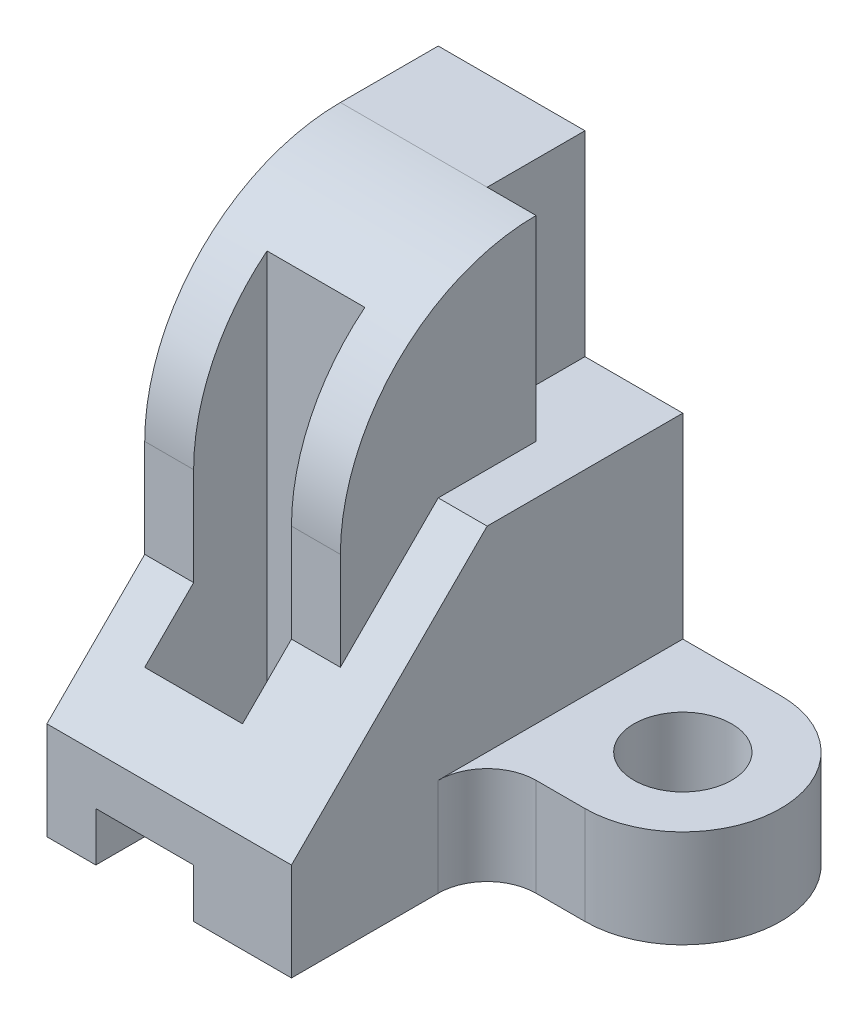
ISO-10303-21;
HEADER;
FILE_DESCRIPTION(('STEP AP214'),'2;1');
FILE_NAME('part.step','',(''),(''),'','','');
FILE_SCHEMA(('AUTOMOTIVE_DESIGN { 1 0 10303 214 1 1 1 1 }'));
ENDSEC;
DATA;
#1=APPLICATION_CONTEXT('core data for automotive mechanical design processes');
#2=APPLICATION_PROTOCOL_DEFINITION('international standard','automotive_design',2000,#1);
#3=PRODUCT_CONTEXT('',#1,'mechanical');
#4=PRODUCT('Part','Part','',(#3));
#5=PRODUCT_RELATED_PRODUCT_CATEGORY('part','',(#4));
#6=PRODUCT_DEFINITION_FORMATION('','',#4);
#7=PRODUCT_DEFINITION_CONTEXT('part definition',#1,'design');
#8=PRODUCT_DEFINITION('design','',#6,#7);
#9=PRODUCT_DEFINITION_SHAPE('','',#8);
#10=(LENGTH_UNIT() NAMED_UNIT(*) SI_UNIT(.MILLI.,.METRE.));
#11=(NAMED_UNIT(*) PLANE_ANGLE_UNIT() SI_UNIT($,.RADIAN.));
#12=(NAMED_UNIT(*) SI_UNIT($,.STERADIAN.) SOLID_ANGLE_UNIT());
#13=UNCERTAINTY_MEASURE_WITH_UNIT(LENGTH_MEASURE(1.E-05),#10,'distance_accuracy_value','');
#14=(GEOMETRIC_REPRESENTATION_CONTEXT(3) GLOBAL_UNCERTAINTY_ASSIGNED_CONTEXT((#13)) GLOBAL_UNIT_ASSIGNED_CONTEXT((#10,
#11,#12)) REPRESENTATION_CONTEXT('',''));
#15=CARTESIAN_POINT('',(0.,0.,0.));
#16=DIRECTION('',(0.,0.,1.));
#17=DIRECTION('',(1.,0.,0.));
#18=AXIS2_PLACEMENT_3D('',#15,#16,#17);
#19=CARTESIAN_POINT('',(-6.,4.,6.));
#20=DIRECTION('',(0.,0.,-1.));
#21=DIRECTION('',(-1.,0.,0.));
#22=AXIS2_PLACEMENT_3D('',#19,#20,#21);
#23=PLANE('',#22);
#24=DIRECTION('',(1.,0.,0.));
#25=VECTOR('',#24,1.);
#26=CARTESIAN_POINT('',(-6.,6.,6.));
#27=LINE('',#26,#25);
#28=CARTESIAN_POINT('',(-2.,6.,6.));
#29=VERTEX_POINT('',#28);
#30=CARTESIAN_POINT('',(-1.,6.,6.));
#31=VERTEX_POINT('',#30);
#32=EDGE_CURVE('E256',#29,#31,#27,.T.);
#33=ORIENTED_EDGE('',*,*,#32,.F.);
#34=DIRECTION('',(0.,-1.,0.));
#35=VECTOR('',#34,1.);
#36=CARTESIAN_POINT('',(-2.,4.,6.));
#37=LINE('',#36,#35);
#38=CARTESIAN_POINT('',(-2.,4.,6.));
#39=VERTEX_POINT('',#38);
#40=EDGE_CURVE('E260',#29,#39,#37,.T.);
#41=ORIENTED_EDGE('',*,*,#40,.T.);
#42=DIRECTION('',(1.,0.,0.));
#43=VECTOR('',#42,1.);
#44=CARTESIAN_POINT('',(-6.,4.,6.));
#45=LINE('',#44,#43);
#46=CARTESIAN_POINT('',(-1.,4.,6.));
#47=VERTEX_POINT('',#46);
#48=EDGE_CURVE('E271',#39,#47,#45,.T.);
#49=ORIENTED_EDGE('',*,*,#48,.T.);
#50=DIRECTION('',(0.,-1.,0.));
#51=VECTOR('',#50,1.);
#52=CARTESIAN_POINT('',(-1.,4.,6.));
#53=LINE('',#52,#51);
#54=EDGE_CURVE('E263',#31,#47,#53,.T.);
#55=ORIENTED_EDGE('',*,*,#54,.F.);
#56=EDGE_LOOP('',(#33,#41,#49,#55));
#57=FACE_BOUND('',#56,.T.);
#58=ADVANCED_FACE('F33',(#57),#23,.F.);
#59=CARTESIAN_POINT('',(-2.,1.,8.));
#60=DIRECTION('',(0.,1.,0.));
#61=DIRECTION('',(-1.,0.,0.));
#62=AXIS2_PLACEMENT_3D('',#59,#60,#61);
#63=PLANE('',#62);
#64=DIRECTION('',(0.,0.,-1.));
#65=VECTOR('',#64,1.);
#66=CARTESIAN_POINT('',(-2.,1.,8.));
#67=LINE('',#66,#65);
#68=CARTESIAN_POINT('',(-2.,1.,4.5));
#69=VERTEX_POINT('',#68);
#70=CARTESIAN_POINT('',(-2.,1.,0.));
#71=VERTEX_POINT('',#70);
#72=EDGE_CURVE('E222',#69,#71,#67,.T.);
#73=ORIENTED_EDGE('',*,*,#72,.F.);
#74=DIRECTION('',(1.,0.,0.));
#75=VECTOR('',#74,1.);
#76=CARTESIAN_POINT('',(-4.,1.,4.5));
#77=LINE('',#76,#75);
#78=CARTESIAN_POINT('',(-4.,1.,4.5));
#79=VERTEX_POINT('',#78);
#80=EDGE_CURVE('E48',#79,#69,#77,.T.);
#81=ORIENTED_EDGE('',*,*,#80,.F.);
#82=DIRECTION('',(0.,0.,-1.));
#83=VECTOR('',#82,1.);
#84=CARTESIAN_POINT('',(-4.,1.,8.));
#85=LINE('',#84,#83);
#86=CARTESIAN_POINT('',(-4.,1.,0.));
#87=VERTEX_POINT('',#86);
#88=EDGE_CURVE('E221',#79,#87,#85,.T.);
#89=ORIENTED_EDGE('',*,*,#88,.T.);
#90=DIRECTION('',(1.,0.,0.));
#91=VECTOR('',#90,1.);
#92=CARTESIAN_POINT('',(-2.,1.,0.));
#93=LINE('',#92,#91);
#94=EDGE_CURVE('E381',#87,#71,#93,.T.);
#95=ORIENTED_EDGE('',*,*,#94,.T.);
#96=EDGE_LOOP('',(#73,#81,#89,#95));
#97=FACE_BOUND('',#96,.T.);
#98=ADVANCED_FACE('F426',(#97),#63,.F.);
#99=CARTESIAN_POINT('',(-5.,4.,6.));
#100=VERTEX_POINT('',#99);
#101=CARTESIAN_POINT('',(-4.,4.,6.));
#102=VERTEX_POINT('',#101);
#103=EDGE_CURVE('E266',#100,#102,#45,.T.);
#104=ORIENTED_EDGE('',*,*,#103,.T.);
#105=DIRECTION('',(0.,1.,0.));
#106=VECTOR('',#105,1.);
#107=CARTESIAN_POINT('',(-4.,4.,6.));
#108=LINE('',#107,#106);
#109=CARTESIAN_POINT('',(-4.,6.,6.));
#110=VERTEX_POINT('',#109);
#111=EDGE_CURVE('E447',#102,#110,#108,.T.);
#112=ORIENTED_EDGE('',*,*,#111,.T.);
#113=CARTESIAN_POINT('',(-5.,6.,6.));
#114=VERTEX_POINT('',#113);
#115=EDGE_CURVE('E265',#114,#110,#27,.T.);
#116=ORIENTED_EDGE('',*,*,#115,.F.);
#117=DIRECTION('',(0.,1.,0.));
#118=VECTOR('',#117,1.);
#119=CARTESIAN_POINT('',(-5.,0.,6.));
#120=LINE('',#119,#118);
#121=EDGE_CURVE('E244',#100,#114,#120,.T.);
#122=ORIENTED_EDGE('',*,*,#121,.F.);
#123=EDGE_LOOP('',(#104,#112,#116,#122));
#124=FACE_BOUND('',#123,.T.);
#125=ADVANCED_FACE('F428',(#124),#23,.F.);
#126=CARTESIAN_POINT('',(-5.,10.,8.));
#127=DIRECTION('',(0.,-1.,0.));
#128=DIRECTION('',(0.,0.,-1.));
#129=AXIS2_PLACEMENT_3D('',#126,#127,#128);
#130=PLANE('',#129);
#131=DIRECTION('',(1.,0.,0.));
#132=VECTOR('',#131,1.);
#133=CARTESIAN_POINT('',(-6.,10.,2.));
#134=LINE('',#133,#132);
#135=CARTESIAN_POINT('',(-5.,10.,2.));
#136=VERTEX_POINT('',#135);
#137=CARTESIAN_POINT('',(-2.,10.,2.));
#138=VERTEX_POINT('',#137);
#139=EDGE_CURVE('E277',#136,#138,#134,.T.);
#140=ORIENTED_EDGE('',*,*,#139,.T.);
#141=DIRECTION('',(0.,0.,1.));
#142=VECTOR('',#141,1.);
#143=CARTESIAN_POINT('',(-2.,10.,0.));
#144=LINE('',#143,#142);
#145=CARTESIAN_POINT('',(-2.,10.,0.));
#146=VERTEX_POINT('',#145);
#147=EDGE_CURVE('E290',#146,#138,#144,.T.);
#148=ORIENTED_EDGE('',*,*,#147,.F.);
#149=DIRECTION('',(-1.,0.,0.));
#150=VECTOR('',#149,1.);
#151=CARTESIAN_POINT('',(-5.,10.,0.));
#152=LINE('',#151,#150);
#153=CARTESIAN_POINT('',(-5.,10.,0.));
#154=VERTEX_POINT('',#153);
#155=EDGE_CURVE('E371',#146,#154,#152,.T.);
#156=ORIENTED_EDGE('',*,*,#155,.T.);
#157=DIRECTION('',(0.,0.,-1.));
#158=VECTOR('',#157,1.);
#159=CARTESIAN_POINT('',(-5.,10.,8.));
#160=LINE('',#159,#158);
#161=EDGE_CURVE('E235',#136,#154,#160,.T.);
#162=ORIENTED_EDGE('',*,*,#161,.F.);
#163=EDGE_LOOP('',(#140,#148,#156,#162));
#164=FACE_BOUND('',#163,.T.);
#165=ADVANCED_FACE('F437',(#164),#130,.F.);
#166=CARTESIAN_POINT('',(0.,6.,8.));
#167=DIRECTION('',(-1.,0.,0.));
#168=DIRECTION('',(0.,-1.,0.));
#169=AXIS2_PLACEMENT_3D('',#166,#167,#168);
#170=PLANE('',#169);
#171=DIRECTION('',(0.,0.,-1.));
#172=VECTOR('',#171,1.);
#173=CARTESIAN_POINT('',(0.,6.,8.));
#174=LINE('',#173,#172);
#175=CARTESIAN_POINT('',(0.,6.,4.));
#176=VERTEX_POINT('',#175);
#177=CARTESIAN_POINT('',(0.,6.,0.));
#178=VERTEX_POINT('',#177);
#179=EDGE_CURVE('E239',#176,#178,#174,.T.);
#180=ORIENTED_EDGE('',*,*,#179,.F.);
#181=DIRECTION('',(0.,-0.707106781186548,0.707106781186547));
#182=VECTOR('',#181,1.);
#183=CARTESIAN_POINT('',(0.,4.,6.));
#184=LINE('',#183,#182);
#185=CARTESIAN_POINT('',(0.,2.,8.));
#186=VERTEX_POINT('',#185);
#187=EDGE_CURVE('E287',#176,#186,#184,.T.);
#188=ORIENTED_EDGE('',*,*,#187,.T.);
#189=DIRECTION('',(0.,1.,0.));
#190=VECTOR('',#189,1.);
#191=CARTESIAN_POINT('',(0.,6.,8.));
#192=LINE('',#191,#190);
#193=CARTESIAN_POINT('',(0.,0.,8.));
#194=VERTEX_POINT('',#193);
#195=EDGE_CURVE('E351',#194,#186,#192,.T.);
#196=ORIENTED_EDGE('',*,*,#195,.F.);
#197=DIRECTION('',(0.,0.,-1.));
#198=VECTOR('',#197,1.);
#199=CARTESIAN_POINT('',(0.,0.,8.));
#200=LINE('',#199,#198);
#201=CARTESIAN_POINT('',(0.,0.,5.));
#202=VERTEX_POINT('',#201);
#203=EDGE_CURVE('E366',#194,#202,#200,.T.);
#204=ORIENTED_EDGE('',*,*,#203,.T.);
#205=DIRECTION('',(0.,-1.,0.));
#206=VECTOR('',#205,1.);
#207=CARTESIAN_POINT('',(0.,2.,5.));
#208=LINE('',#207,#206);
#209=CARTESIAN_POINT('',(0.,2.,5.));
#210=VERTEX_POINT('',#209);
#211=EDGE_CURVE('E341',#210,#202,#208,.T.);
#212=ORIENTED_EDGE('',*,*,#211,.F.);
#213=DIRECTION('',(0.,0.,-1.));
#214=VECTOR('',#213,1.);
#215=CARTESIAN_POINT('',(0.,2.,5.));
#216=LINE('',#215,#214);
#217=CARTESIAN_POINT('',(0.,2.,0.));
#218=VERTEX_POINT('',#217);
#219=EDGE_CURVE('E317',#210,#218,#216,.T.);
#220=ORIENTED_EDGE('',*,*,#219,.T.);
#221=DIRECTION('',(0.,1.,0.));
#222=VECTOR('',#221,1.);
#223=CARTESIAN_POINT('',(0.,6.,0.));
#224=LINE('',#223,#222);
#225=EDGE_CURVE('E344',#218,#178,#224,.T.);
#226=ORIENTED_EDGE('',*,*,#225,.T.);
#227=EDGE_LOOP('',(#180,#188,#196,#204,#212,#220,#226));
#228=FACE_BOUND('',#227,.T.);
#229=ADVANCED_FACE('F35',(#228),#170,.F.);
#230=CARTESIAN_POINT('',(-1.,6.,8.));
#231=DIRECTION('',(0.,-1.,0.));
#232=DIRECTION('',(0.,0.,-1.));
#233=AXIS2_PLACEMENT_3D('',#230,#231,#232);
#234=PLANE('',#233);
#235=DIRECTION('',(0.,0.,-1.));
#236=VECTOR('',#235,1.);
#237=CARTESIAN_POINT('',(-1.,6.,8.));
#238=LINE('',#237,#236);
#239=CARTESIAN_POINT('',(-1.,6.,4.));
#240=VERTEX_POINT('',#239);
#241=CARTESIAN_POINT('',(-1.,6.,2.));
#242=VERTEX_POINT('',#241);
#243=EDGE_CURVE('E237',#240,#242,#238,.T.);
#244=ORIENTED_EDGE('',*,*,#243,.F.);
#245=DIRECTION('',(1.,0.,0.));
#246=VECTOR('',#245,1.);
#247=CARTESIAN_POINT('',(-1.,6.,4.));
#248=LINE('',#247,#246);
#249=EDGE_CURVE('E274',#240,#176,#248,.T.);
#250=ORIENTED_EDGE('',*,*,#249,.T.);
#251=ORIENTED_EDGE('',*,*,#179,.T.);
#252=DIRECTION('',(-1.,0.,0.));
#253=VECTOR('',#252,1.);
#254=CARTESIAN_POINT('',(-1.,6.,0.));
#255=LINE('',#254,#253);
#256=CARTESIAN_POINT('',(-2.,6.,0.));
#257=VERTEX_POINT('',#256);
#258=EDGE_CURVE('E369',#178,#257,#255,.T.);
#259=ORIENTED_EDGE('',*,*,#258,.T.);
#260=DIRECTION('',(0.,0.,1.));
#261=VECTOR('',#260,1.);
#262=CARTESIAN_POINT('',(-2.,6.,0.));
#263=LINE('',#262,#261);
#264=CARTESIAN_POINT('',(-2.,6.,2.));
#265=VERTEX_POINT('',#264);
#266=EDGE_CURVE('E291',#257,#265,#263,.T.);
#267=ORIENTED_EDGE('',*,*,#266,.T.);
#268=DIRECTION('',(1.,0.,0.));
#269=VECTOR('',#268,1.);
#270=CARTESIAN_POINT('',(-2.,6.,2.));
#271=LINE('',#270,#269);
#272=EDGE_CURVE('E294',#265,#242,#271,.T.);
#273=ORIENTED_EDGE('',*,*,#272,.T.);
#274=EDGE_LOOP('',(#244,#250,#251,#259,#267,#273));
#275=FACE_BOUND('',#274,.T.);
#276=ADVANCED_FACE('F464',(#275),#234,.F.);
#277=CARTESIAN_POINT('',(-1.,10.,8.));
#278=DIRECTION('',(-1.,0.,0.));
#279=DIRECTION('',(0.,-1.,0.));
#280=AXIS2_PLACEMENT_3D('',#277,#278,#279);
#281=PLANE('',#280);
#282=DIRECTION('',(0.,1.,0.));
#283=VECTOR('',#282,1.);
#284=CARTESIAN_POINT('',(-1.,6.,2.));
#285=LINE('',#284,#283);
#286=CARTESIAN_POINT('',(-1.,10.,2.));
#287=VERTEX_POINT('',#286);
#288=EDGE_CURVE('E303',#242,#287,#285,.T.);
#289=ORIENTED_EDGE('',*,*,#288,.T.);
#290=CARTESIAN_POINT('',(-0.999999999999999,5.99999999999997,1.99999999999997));
#291=DIRECTION('',(-1.,0.,0.));
#292=DIRECTION('',(0.,-1.,0.));
#293=AXIS2_PLACEMENT_3D('',#290,#291,#292);
#294=CIRCLE('',#293,4.00000000000003);
#295=EDGE_CURVE('E282',#287,#31,#294,.F.);
#296=ORIENTED_EDGE('',*,*,#295,.T.);
#297=ORIENTED_EDGE('',*,*,#54,.T.);
#298=DIRECTION('',(0.,0.707106781186548,-0.707106781186548));
#299=VECTOR('',#298,1.);
#300=CARTESIAN_POINT('',(-1.,6.,4.));
#301=LINE('',#300,#299);
#302=EDGE_CURVE('E468',#47,#240,#301,.T.);
#303=ORIENTED_EDGE('',*,*,#302,.T.);
#304=ORIENTED_EDGE('',*,*,#243,.T.);
#305=EDGE_LOOP('',(#289,#296,#297,#303,#304));
#306=FACE_BOUND('',#305,.T.);
#307=ADVANCED_FACE('F496',(#306),#281,.F.);
#308=CARTESIAN_POINT('',(-5.,0.,8.));
#309=DIRECTION('',(1.,0.,0.));
#310=DIRECTION('',(0.,0.,-1.));
#311=AXIS2_PLACEMENT_3D('',#308,#309,#310);
#312=PLANE('',#311);
#313=ORIENTED_EDGE('',*,*,#121,.T.);
#314=CARTESIAN_POINT('',(-5.,5.99999999999997,1.99999999999997));
#315=DIRECTION('',(1.,0.,0.));
#316=DIRECTION('',(0.,0.,-1.));
#317=AXIS2_PLACEMENT_3D('',#314,#315,#316);
#318=CIRCLE('',#317,4.00000000000003);
#319=EDGE_CURVE('E269',#114,#136,#318,.F.);
#320=ORIENTED_EDGE('',*,*,#319,.T.);
#321=ORIENTED_EDGE('',*,*,#161,.T.);
#322=DIRECTION('',(0.,-1.,0.));
#323=VECTOR('',#322,1.);
#324=CARTESIAN_POINT('',(-5.,0.,0.));
#325=LINE('',#324,#323);
#326=CARTESIAN_POINT('',(-5.,0.,0.));
#327=VERTEX_POINT('',#326);
#328=EDGE_CURVE('E374',#154,#327,#325,.T.);
#329=ORIENTED_EDGE('',*,*,#328,.T.);
#330=DIRECTION('',(0.,0.,-1.));
#331=VECTOR('',#330,1.);
#332=CARTESIAN_POINT('',(-5.,0.,8.));
#333=LINE('',#332,#331);
#334=CARTESIAN_POINT('',(-5.,0.,8.));
#335=VERTEX_POINT('',#334);
#336=EDGE_CURVE('E232',#335,#327,#333,.T.);
#337=ORIENTED_EDGE('',*,*,#336,.F.);
#338=DIRECTION('',(0.,-1.,0.));
#339=VECTOR('',#338,1.);
#340=CARTESIAN_POINT('',(-5.,0.,8.));
#341=LINE('',#340,#339);
#342=CARTESIAN_POINT('',(-5.,2.,8.));
#343=VERTEX_POINT('',#342);
#344=EDGE_CURVE('E354',#343,#335,#341,.T.);
#345=ORIENTED_EDGE('',*,*,#344,.F.);
#346=DIRECTION('',(0.,0.707106781186548,-0.707106781186547));
#347=VECTOR('',#346,1.);
#348=CARTESIAN_POINT('',(-5.,0.999999999999997,9.));
#349=LINE('',#348,#347);
#350=EDGE_CURVE('E284',#343,#100,#349,.T.);
#351=ORIENTED_EDGE('',*,*,#350,.T.);
#352=EDGE_LOOP('',(#313,#320,#321,#329,#337,#345,#351));
#353=FACE_BOUND('',#352,.T.);
#354=ADVANCED_FACE('F454',(#353),#312,.F.);
#355=CARTESIAN_POINT('',(-4.,0.,8.));
#356=DIRECTION('',(0.,1.,0.));
#357=DIRECTION('',(-1.,0.,0.));
#358=AXIS2_PLACEMENT_3D('',#355,#356,#357);
#359=PLANE('',#358);
#360=DIRECTION('',(1.,0.,0.));
#361=VECTOR('',#360,1.);
#362=CARTESIAN_POINT('',(-4.,0.,0.));
#363=LINE('',#362,#361);
#364=CARTESIAN_POINT('',(-4.,0.,0.));
#365=VERTEX_POINT('',#364);
#366=EDGE_CURVE('E376',#327,#365,#363,.T.);
#367=ORIENTED_EDGE('',*,*,#366,.T.);
#368=DIRECTION('',(0.,0.,-1.));
#369=VECTOR('',#368,1.);
#370=CARTESIAN_POINT('',(-4.,0.,8.));
#371=LINE('',#370,#369);
#372=CARTESIAN_POINT('',(-4.,0.,8.));
#373=VERTEX_POINT('',#372);
#374=EDGE_CURVE('E229',#373,#365,#371,.T.);
#375=ORIENTED_EDGE('',*,*,#374,.F.);
#376=DIRECTION('',(1.,0.,0.));
#377=VECTOR('',#376,1.);
#378=CARTESIAN_POINT('',(-4.,0.,8.));
#379=LINE('',#378,#377);
#380=EDGE_CURVE('E357',#335,#373,#379,.T.);
#381=ORIENTED_EDGE('',*,*,#380,.F.);
#382=ORIENTED_EDGE('',*,*,#336,.T.);
#383=EDGE_LOOP('',(#367,#375,#381,#382));
#384=FACE_BOUND('',#383,.T.);
#385=ADVANCED_FACE('F488',(#384),#359,.F.);
#386=CARTESIAN_POINT('',(-4.,1.,8.));
#387=DIRECTION('',(-1.,0.,0.));
#388=DIRECTION('',(0.,0.,1.));
#389=AXIS2_PLACEMENT_3D('',#386,#387,#388);
#390=PLANE('',#389);
#391=DIRECTION('',(0.,1.,0.));
#392=VECTOR('',#391,1.);
#393=CARTESIAN_POINT('',(-4.,1.,0.));
#394=LINE('',#393,#392);
#395=EDGE_CURVE('E378',#365,#87,#394,.T.);
#396=ORIENTED_EDGE('',*,*,#395,.T.);
#397=ORIENTED_EDGE('',*,*,#88,.F.);
#398=DIRECTION('',(0.,-1.,0.));
#399=VECTOR('',#398,1.);
#400=CARTESIAN_POINT('',(-4.,10.,4.5));
#401=LINE('',#400,#399);
#402=CARTESIAN_POINT('',(-4.,9.12249899919918,4.5));
#403=VERTEX_POINT('',#402);
#404=EDGE_CURVE('E55',#403,#79,#401,.T.);
#405=ORIENTED_EDGE('',*,*,#404,.F.);
#406=CARTESIAN_POINT('',(-4.,5.99999999999997,1.99999999999997));
#407=DIRECTION('',(-1.,0.,0.));
#408=DIRECTION('',(0.,-1.,0.));
#409=AXIS2_PLACEMENT_3D('',#406,#407,#408);
#410=CIRCLE('',#409,4.00000000000003);
#411=EDGE_CURVE('E247',#110,#403,#410,.T.);
#412=ORIENTED_EDGE('',*,*,#411,.F.);
#413=ORIENTED_EDGE('',*,*,#111,.F.);
#414=DIRECTION('',(0.,0.707106781186548,-0.707106781186547));
#415=VECTOR('',#414,1.);
#416=CARTESIAN_POINT('',(-4.,4.,6.));
#417=LINE('',#416,#415);
#418=CARTESIAN_POINT('',(-4.,3.,7.));
#419=VERTEX_POINT('',#418);
#420=EDGE_CURVE('E451',#419,#102,#417,.T.);
#421=ORIENTED_EDGE('',*,*,#420,.F.);
#422=DIRECTION('',(0.,-1.,0.));
#423=VECTOR('',#422,1.);
#424=CARTESIAN_POINT('',(-4.,10.,7.));
#425=LINE('',#424,#423);
#426=CARTESIAN_POINT('',(-4.,1.,7.));
#427=VERTEX_POINT('',#426);
#428=EDGE_CURVE('E207',#419,#427,#425,.T.);
#429=ORIENTED_EDGE('',*,*,#428,.T.);
#430=CARTESIAN_POINT('',(-4.,1.,8.));
#431=VERTEX_POINT('',#430);
#432=EDGE_CURVE('E216',#431,#427,#85,.T.);
#433=ORIENTED_EDGE('',*,*,#432,.F.);
#434=DIRECTION('',(0.,1.,0.));
#435=VECTOR('',#434,1.);
#436=CARTESIAN_POINT('',(-4.,1.,8.));
#437=LINE('',#436,#435);
#438=EDGE_CURVE('E359',#373,#431,#437,.T.);
#439=ORIENTED_EDGE('',*,*,#438,.F.);
#440=ORIENTED_EDGE('',*,*,#374,.T.);
#441=EDGE_LOOP('',(#396,#397,#405,#412,#413,#421,#429,#433,#439,#440));
#442=FACE_BOUND('',#441,.T.);
#443=ADVANCED_FACE('F485',(#442),#390,.F.);
#444=ORIENTED_EDGE('',*,*,#432,.T.);
#445=DIRECTION('',(-1.,0.,0.));
#446=VECTOR('',#445,1.);
#447=CARTESIAN_POINT('',(-2.,1.,7.));
#448=LINE('',#447,#446);
#449=CARTESIAN_POINT('',(-2.,1.,7.));
#450=VERTEX_POINT('',#449);
#451=EDGE_CURVE('E202',#450,#427,#448,.T.);
#452=ORIENTED_EDGE('',*,*,#451,.F.);
#453=CARTESIAN_POINT('',(-2.,1.,8.));
#454=VERTEX_POINT('',#453);
#455=EDGE_CURVE('E213',#454,#450,#67,.T.);
#456=ORIENTED_EDGE('',*,*,#455,.F.);
#457=DIRECTION('',(1.,0.,0.));
#458=VECTOR('',#457,1.);
#459=CARTESIAN_POINT('',(-2.,1.,8.));
#460=LINE('',#459,#458);
#461=EDGE_CURVE('E361',#431,#454,#460,.T.);
#462=ORIENTED_EDGE('',*,*,#461,.F.);
#463=EDGE_LOOP('',(#444,#452,#456,#462));
#464=FACE_BOUND('',#463,.T.);
#465=ADVANCED_FACE('F211',(#464),#63,.F.);
#466=CARTESIAN_POINT('',(-2.,0.,8.));
#467=DIRECTION('',(1.,0.,0.));
#468=DIRECTION('',(0.,0.,-1.));
#469=AXIS2_PLACEMENT_3D('',#466,#467,#468);
#470=PLANE('',#469);
#471=DIRECTION('',(0.,-1.,0.));
#472=VECTOR('',#471,1.);
#473=CARTESIAN_POINT('',(-2.,0.,0.));
#474=LINE('',#473,#472);
#475=CARTESIAN_POINT('',(-2.,0.,0.));
#476=VERTEX_POINT('',#475);
#477=EDGE_CURVE('E384',#71,#476,#474,.T.);
#478=ORIENTED_EDGE('',*,*,#477,.T.);
#479=DIRECTION('',(0.,0.,-1.));
#480=VECTOR('',#479,1.);
#481=CARTESIAN_POINT('',(-2.,0.,8.));
#482=LINE('',#481,#480);
#483=CARTESIAN_POINT('',(-2.,0.,8.));
#484=VERTEX_POINT('',#483);
#485=EDGE_CURVE('E225',#484,#476,#482,.T.);
#486=ORIENTED_EDGE('',*,*,#485,.F.);
#487=DIRECTION('',(0.,-1.,0.));
#488=VECTOR('',#487,1.);
#489=CARTESIAN_POINT('',(-2.,0.,8.));
#490=LINE('',#489,#488);
#491=EDGE_CURVE('E220',#454,#484,#490,.T.);
#492=ORIENTED_EDGE('',*,*,#491,.F.);
#493=ORIENTED_EDGE('',*,*,#455,.T.);
#494=DIRECTION('',(0.,-1.,0.));
#495=VECTOR('',#494,1.);
#496=CARTESIAN_POINT('',(-2.,10.,7.));
#497=LINE('',#496,#495);
#498=CARTESIAN_POINT('',(-2.,3.,7.));
#499=VERTEX_POINT('',#498);
#500=EDGE_CURVE('E198',#499,#450,#497,.T.);
#501=ORIENTED_EDGE('',*,*,#500,.F.);
#502=DIRECTION('',(0.,-0.707106781186548,0.707106781186547));
#503=VECTOR('',#502,1.);
#504=CARTESIAN_POINT('',(-2.,4.,6.));
#505=LINE('',#504,#503);
#506=EDGE_CURVE('E470',#39,#499,#505,.T.);
#507=ORIENTED_EDGE('',*,*,#506,.F.);
#508=ORIENTED_EDGE('',*,*,#40,.F.);
#509=CARTESIAN_POINT('',(-2.,5.99999999999997,1.99999999999997));
#510=DIRECTION('',(1.,0.,0.));
#511=DIRECTION('',(0.,1.,0.));
#512=AXIS2_PLACEMENT_3D('',#509,#510,#511);
#513=CIRCLE('',#512,4.00000000000003);
#514=CARTESIAN_POINT('',(-2.,9.12249899919918,4.5));
#515=VERTEX_POINT('',#514);
#516=EDGE_CURVE('E41',#515,#29,#513,.T.);
#517=ORIENTED_EDGE('',*,*,#516,.F.);
#518=DIRECTION('',(0.,-1.,0.));
#519=VECTOR('',#518,1.);
#520=CARTESIAN_POINT('',(-2.,10.,4.5));
#521=LINE('',#520,#519);
#522=EDGE_CURVE('E476',#515,#69,#521,.T.);
#523=ORIENTED_EDGE('',*,*,#522,.T.);
#524=ORIENTED_EDGE('',*,*,#72,.T.);
#525=EDGE_LOOP('',(#478,#486,#492,#493,#501,#507,#508,#517,#523,#524));
#526=FACE_BOUND('',#525,.T.);
#527=ADVANCED_FACE('F218',(#526),#470,.F.);
#528=CARTESIAN_POINT('',(0.,0.,8.));
#529=DIRECTION('',(0.,1.,0.));
#530=DIRECTION('',(0.,0.,1.));
#531=AXIS2_PLACEMENT_3D('',#528,#529,#530);
#532=PLANE('',#531);
#533=DIRECTION('',(1.,0.,0.));
#534=VECTOR('',#533,1.);
#535=CARTESIAN_POINT('',(0.,0.,0.));
#536=LINE('',#535,#534);
#537=CARTESIAN_POINT('',(2.,0.,0.));
#538=VERTEX_POINT('',#537);
#539=EDGE_CURVE('E355',#476,#538,#536,.T.);
#540=ORIENTED_EDGE('',*,*,#539,.T.);
#541=CARTESIAN_POINT('',(2.,0.,2.));
#542=DIRECTION('',(0.,-1.,0.));
#543=DIRECTION('',(0.,0.,1.));
#544=AXIS2_PLACEMENT_3D('',#541,#542,#543);
#545=CIRCLE('',#544,2.);
#546=CARTESIAN_POINT('',(2.,0.,4.));
#547=VERTEX_POINT('',#546);
#548=EDGE_CURVE('E314',#538,#547,#545,.T.);
#549=ORIENTED_EDGE('',*,*,#548,.T.);
#550=DIRECTION('',(-1.,0.,0.));
#551=VECTOR('',#550,1.);
#552=CARTESIAN_POINT('',(1.,0.,4.));
#553=LINE('',#552,#551);
#554=CARTESIAN_POINT('',(1.,0.,4.));
#555=VERTEX_POINT('',#554);
#556=EDGE_CURVE('E336',#547,#555,#553,.T.);
#557=ORIENTED_EDGE('',*,*,#556,.T.);
#558=CARTESIAN_POINT('',(1.,0.,5.));
#559=DIRECTION('',(0.,1.,0.));
#560=DIRECTION('',(0.,0.,1.));
#561=AXIS2_PLACEMENT_3D('',#558,#559,#560);
#562=CIRCLE('',#561,1.);
#563=EDGE_CURVE('E321',#555,#202,#562,.T.);
#564=ORIENTED_EDGE('',*,*,#563,.T.);
#565=ORIENTED_EDGE('',*,*,#203,.F.);
#566=DIRECTION('',(1.,0.,0.));
#567=VECTOR('',#566,1.);
#568=CARTESIAN_POINT('',(0.,0.,8.));
#569=LINE('',#568,#567);
#570=EDGE_CURVE('E364',#484,#194,#569,.T.);
#571=ORIENTED_EDGE('',*,*,#570,.F.);
#572=ORIENTED_EDGE('',*,*,#485,.T.);
#573=EDGE_LOOP('',(#540,#549,#557,#564,#565,#571,#572));
#574=FACE_BOUND('',#573,.T.);
#575=CARTESIAN_POINT('',(2.,0.,2.));
#576=DIRECTION('',(0.,-1.,0.));
#577=DIRECTION('',(0.,0.,-1.));
#578=AXIS2_PLACEMENT_3D('',#575,#576,#577);
#579=CIRCLE('',#578,1.);
#580=CARTESIAN_POINT('',(2.,0.,1.));
#581=VERTEX_POINT('',#580);
#582=EDGE_CURVE('E306',#581,#581,#579,.T.);
#583=ORIENTED_EDGE('',*,*,#582,.F.);
#584=EDGE_LOOP('',(#583));
#585=FACE_BOUND('',#584,.T.);
#586=ADVANCED_FACE('F393',(#574,#585),#532,.F.);
#587=CARTESIAN_POINT('',(0.,0.,8.));
#588=DIRECTION('',(0.,0.,-1.));
#589=DIRECTION('',(-1.,0.,0.));
#590=AXIS2_PLACEMENT_3D('',#587,#588,#589);
#591=PLANE('',#590);
#592=ORIENTED_EDGE('',*,*,#195,.T.);
#593=DIRECTION('',(-1.,0.,0.));
#594=VECTOR('',#593,1.);
#595=CARTESIAN_POINT('',(0.,2.,8.));
#596=LINE('',#595,#594);
#597=EDGE_CURVE('E241',#186,#343,#596,.T.);
#598=ORIENTED_EDGE('',*,*,#597,.T.);
#599=ORIENTED_EDGE('',*,*,#344,.T.);
#600=ORIENTED_EDGE('',*,*,#380,.T.);
#601=ORIENTED_EDGE('',*,*,#438,.T.);
#602=ORIENTED_EDGE('',*,*,#461,.T.);
#603=ORIENTED_EDGE('',*,*,#491,.T.);
#604=ORIENTED_EDGE('',*,*,#570,.T.);
#605=EDGE_LOOP('',(#592,#598,#599,#600,#601,#602,#603,#604));
#606=FACE_BOUND('',#605,.T.);
#607=ADVANCED_FACE('F458',(#606),#591,.F.);
#608=CARTESIAN_POINT('',(0.,0.,0.));
#609=DIRECTION('',(0.,0.,-1.));
#610=DIRECTION('',(-1.,0.,0.));
#611=AXIS2_PLACEMENT_3D('',#608,#609,#610);
#612=PLANE('',#611);
#613=DIRECTION('',(0.,1.,0.));
#614=VECTOR('',#613,1.);
#615=CARTESIAN_POINT('',(-2.,6.,0.));
#616=LINE('',#615,#614);
#617=EDGE_CURVE('E298',#257,#146,#616,.T.);
#618=ORIENTED_EDGE('',*,*,#617,.F.);
#619=ORIENTED_EDGE('',*,*,#258,.F.);
#620=ORIENTED_EDGE('',*,*,#225,.F.);
#621=DIRECTION('',(1.,0.,0.));
#622=VECTOR('',#621,1.);
#623=CARTESIAN_POINT('',(0.,2.,0.));
#624=LINE('',#623,#622);
#625=CARTESIAN_POINT('',(2.,2.,0.));
#626=VERTEX_POINT('',#625);
#627=EDGE_CURVE('E320',#218,#626,#624,.T.);
#628=ORIENTED_EDGE('',*,*,#627,.T.);
#629=DIRECTION('',(0.,-1.,0.));
#630=VECTOR('',#629,1.);
#631=CARTESIAN_POINT('',(2.,2.,0.));
#632=LINE('',#631,#630);
#633=EDGE_CURVE('E333',#626,#538,#632,.T.);
#634=ORIENTED_EDGE('',*,*,#633,.T.);
#635=ORIENTED_EDGE('',*,*,#539,.F.);
#636=ORIENTED_EDGE('',*,*,#477,.F.);
#637=ORIENTED_EDGE('',*,*,#94,.F.);
#638=ORIENTED_EDGE('',*,*,#395,.F.);
#639=ORIENTED_EDGE('',*,*,#366,.F.);
#640=ORIENTED_EDGE('',*,*,#328,.F.);
#641=ORIENTED_EDGE('',*,*,#155,.F.);
#642=EDGE_LOOP('',(#618,#619,#620,#628,#634,#635,#636,#637,#638,#639,#640,#641));
#643=FACE_BOUND('',#642,.T.);
#644=ADVANCED_FACE('F398',(#643),#612,.T.);
#645=CARTESIAN_POINT('',(1.,2.,5.));
#646=DIRECTION('',(0.,-1.,0.));
#647=DIRECTION('',(0.,0.,-1.));
#648=AXIS2_PLACEMENT_3D('',#645,#646,#647);
#649=CYLINDRICAL_SURFACE('',#648,1.);
#650=ORIENTED_EDGE('',*,*,#563,.F.);
#651=DIRECTION('',(0.,-1.,0.));
#652=VECTOR('',#651,1.);
#653=CARTESIAN_POINT('',(1.,2.,4.));
#654=LINE('',#653,#652);
#655=CARTESIAN_POINT('',(1.,2.,4.));
#656=VERTEX_POINT('',#655);
#657=EDGE_CURVE('E345',#656,#555,#654,.T.);
#658=ORIENTED_EDGE('',*,*,#657,.F.);
#659=CARTESIAN_POINT('',(1.,2.,5.));
#660=DIRECTION('',(0.,1.,0.));
#661=DIRECTION('',(0.,0.,1.));
#662=AXIS2_PLACEMENT_3D('',#659,#660,#661);
#663=CIRCLE('',#662,1.);
#664=EDGE_CURVE('E330',#656,#210,#663,.T.);
#665=ORIENTED_EDGE('',*,*,#664,.T.);
#666=ORIENTED_EDGE('',*,*,#211,.T.);
#667=EDGE_LOOP('',(#650,#658,#665,#666));
#668=FACE_BOUND('',#667,.T.);
#669=ADVANCED_FACE('F409',(#668),#649,.F.);
#670=CARTESIAN_POINT('',(1.,2.,4.));
#671=DIRECTION('',(0.,0.,1.));
#672=DIRECTION('',(1.,0.,0.));
#673=AXIS2_PLACEMENT_3D('',#670,#671,#672);
#674=PLANE('',#673);
#675=ORIENTED_EDGE('',*,*,#556,.F.);
#676=DIRECTION('',(0.,-1.,0.));
#677=VECTOR('',#676,1.);
#678=CARTESIAN_POINT('',(2.,2.,4.));
#679=LINE('',#678,#677);
#680=CARTESIAN_POINT('',(2.,2.,4.));
#681=VERTEX_POINT('',#680);
#682=EDGE_CURVE('E347',#681,#547,#679,.T.);
#683=ORIENTED_EDGE('',*,*,#682,.F.);
#684=DIRECTION('',(-1.,0.,0.));
#685=VECTOR('',#684,1.);
#686=CARTESIAN_POINT('',(1.,2.,4.));
#687=LINE('',#686,#685);
#688=EDGE_CURVE('E327',#681,#656,#687,.T.);
#689=ORIENTED_EDGE('',*,*,#688,.T.);
#690=ORIENTED_EDGE('',*,*,#657,.T.);
#691=EDGE_LOOP('',(#675,#683,#689,#690));
#692=FACE_BOUND('',#691,.T.);
#693=ADVANCED_FACE('F416',(#692),#674,.T.);
#694=CARTESIAN_POINT('',(2.,2.,2.));
#695=DIRECTION('',(0.,-1.,0.));
#696=DIRECTION('',(0.,0.,-1.));
#697=AXIS2_PLACEMENT_3D('',#694,#695,#696);
#698=CYLINDRICAL_SURFACE('',#697,2.);
#699=ORIENTED_EDGE('',*,*,#548,.F.);
#700=ORIENTED_EDGE('',*,*,#633,.F.);
#701=CARTESIAN_POINT('',(2.,2.,2.));
#702=DIRECTION('',(0.,-1.,0.));
#703=DIRECTION('',(0.,0.,1.));
#704=AXIS2_PLACEMENT_3D('',#701,#702,#703);
#705=CIRCLE('',#704,2.);
#706=EDGE_CURVE('E324',#626,#681,#705,.T.);
#707=ORIENTED_EDGE('',*,*,#706,.T.);
#708=ORIENTED_EDGE('',*,*,#682,.T.);
#709=EDGE_LOOP('',(#699,#700,#707,#708));
#710=FACE_BOUND('',#709,.T.);
#711=ADVANCED_FACE('F404',(#710),#698,.T.);
#712=CARTESIAN_POINT('',(2.,2.,2.));
#713=DIRECTION('',(0.,1.,0.));
#714=DIRECTION('',(0.,0.,1.));
#715=AXIS2_PLACEMENT_3D('',#712,#713,#714);
#716=PLANE('',#715);
#717=CARTESIAN_POINT('',(2.,2.,2.));
#718=DIRECTION('',(0.,-1.,0.));
#719=DIRECTION('',(0.,0.,-1.));
#720=AXIS2_PLACEMENT_3D('',#717,#718,#719);
#721=CIRCLE('',#720,1.);
#722=CARTESIAN_POINT('',(2.,2.,1.));
#723=VERTEX_POINT('',#722);
#724=EDGE_CURVE('E311',#723,#723,#721,.T.);
#725=ORIENTED_EDGE('',*,*,#724,.T.);
#726=EDGE_LOOP('',(#725));
#727=FACE_BOUND('',#726,.T.);
#728=ORIENTED_EDGE('',*,*,#219,.F.);
#729=ORIENTED_EDGE('',*,*,#664,.F.);
#730=ORIENTED_EDGE('',*,*,#688,.F.);
#731=ORIENTED_EDGE('',*,*,#706,.F.);
#732=ORIENTED_EDGE('',*,*,#627,.F.);
#733=EDGE_LOOP('',(#728,#729,#730,#731,#732));
#734=FACE_BOUND('',#733,.T.);
#735=ADVANCED_FACE('F414',(#727,#734),#716,.T.);
#736=CARTESIAN_POINT('',(2.,2.,2.));
#737=DIRECTION('',(0.,-1.,0.));
#738=DIRECTION('',(0.,0.,-1.));
#739=AXIS2_PLACEMENT_3D('',#736,#737,#738);
#740=CYLINDRICAL_SURFACE('',#739,1.);
#741=ORIENTED_EDGE('',*,*,#724,.F.);
#742=EDGE_LOOP('',(#741));
#743=FACE_BOUND('',#742,.T.);
#744=ORIENTED_EDGE('',*,*,#582,.T.);
#745=EDGE_LOOP('',(#744));
#746=FACE_BOUND('',#745,.T.);
#747=ADVANCED_FACE('F547',(#743,#746),#740,.F.);
#748=CARTESIAN_POINT('',(-2.,6.,2.));
#749=DIRECTION('',(0.,0.,1.));
#750=DIRECTION('',(1.,0.,0.));
#751=AXIS2_PLACEMENT_3D('',#748,#749,#750);
#752=PLANE('',#751);
#753=DIRECTION('',(1.,0.,0.));
#754=VECTOR('',#753,1.);
#755=CARTESIAN_POINT('',(-2.,10.,2.));
#756=LINE('',#755,#754);
#757=EDGE_CURVE('E295',#138,#287,#756,.T.);
#758=ORIENTED_EDGE('',*,*,#757,.T.);
#759=ORIENTED_EDGE('',*,*,#288,.F.);
#760=ORIENTED_EDGE('',*,*,#272,.F.);
#761=DIRECTION('',(0.,1.,0.));
#762=VECTOR('',#761,1.);
#763=CARTESIAN_POINT('',(-2.,6.,2.));
#764=LINE('',#763,#762);
#765=EDGE_CURVE('E307',#265,#138,#764,.T.);
#766=ORIENTED_EDGE('',*,*,#765,.T.);
#767=EDGE_LOOP('',(#758,#759,#760,#766));
#768=FACE_BOUND('',#767,.T.);
#769=ADVANCED_FACE('F542',(#768),#752,.F.);
#770=CARTESIAN_POINT('',(-2.,6.,0.));
#771=DIRECTION('',(-1.,0.,0.));
#772=DIRECTION('',(0.,0.,1.));
#773=AXIS2_PLACEMENT_3D('',#770,#771,#772);
#774=PLANE('',#773);
#775=ORIENTED_EDGE('',*,*,#147,.T.);
#776=ORIENTED_EDGE('',*,*,#765,.F.);
#777=ORIENTED_EDGE('',*,*,#266,.F.);
#778=ORIENTED_EDGE('',*,*,#617,.T.);
#779=EDGE_LOOP('',(#775,#776,#777,#778));
#780=FACE_BOUND('',#779,.T.);
#781=ADVANCED_FACE('F546',(#780),#774,.F.);
#782=CARTESIAN_POINT('',(-6.,4.,6.));
#783=DIRECTION('',(0.,-0.707106781186547,-0.707106781186548));
#784=DIRECTION('',(0.,0.707106781186548,-0.707106781186547));
#785=AXIS2_PLACEMENT_3D('',#782,#783,#784);
#786=PLANE('',#785);
#787=ORIENTED_EDGE('',*,*,#48,.F.);
#788=ORIENTED_EDGE('',*,*,#506,.T.);
#789=DIRECTION('',(-1.,0.,0.));
#790=VECTOR('',#789,1.);
#791=CARTESIAN_POINT('',(-6.,3.,7.));
#792=LINE('',#791,#790);
#793=EDGE_CURVE('E11',#499,#419,#792,.T.);
#794=ORIENTED_EDGE('',*,*,#793,.T.);
#795=ORIENTED_EDGE('',*,*,#420,.T.);
#796=ORIENTED_EDGE('',*,*,#103,.F.);
#797=ORIENTED_EDGE('',*,*,#350,.F.);
#798=ORIENTED_EDGE('',*,*,#597,.F.);
#799=ORIENTED_EDGE('',*,*,#187,.F.);
#800=ORIENTED_EDGE('',*,*,#249,.F.);
#801=ORIENTED_EDGE('',*,*,#302,.F.);
#802=EDGE_LOOP('',(#787,#788,#794,#795,#796,#797,#798,#799,#800,#801));
#803=FACE_BOUND('',#802,.T.);
#804=ADVANCED_FACE('F450',(#803),#786,.F.);
#805=CARTESIAN_POINT('',(-6.,5.99999999999997,1.99999999999997));
#806=DIRECTION('',(1.,0.,0.));
#807=DIRECTION('',(0.,1.,0.));
#808=AXIS2_PLACEMENT_3D('',#805,#806,#807);
#809=CYLINDRICAL_SURFACE('',#808,4.00000000000003);
#810=DIRECTION('',(1.,0.,0.));
#811=VECTOR('',#810,1.);
#812=CARTESIAN_POINT('',(-6.,9.12249899919918,4.5));
#813=LINE('',#812,#811);
#814=EDGE_CURVE('E250',#403,#515,#813,.T.);
#815=ORIENTED_EDGE('',*,*,#814,.T.);
#816=ORIENTED_EDGE('',*,*,#516,.T.);
#817=ORIENTED_EDGE('',*,*,#32,.T.);
#818=ORIENTED_EDGE('',*,*,#295,.F.);
#819=ORIENTED_EDGE('',*,*,#757,.F.);
#820=ORIENTED_EDGE('',*,*,#139,.F.);
#821=ORIENTED_EDGE('',*,*,#319,.F.);
#822=ORIENTED_EDGE('',*,*,#115,.T.);
#823=ORIENTED_EDGE('',*,*,#411,.T.);
#824=EDGE_LOOP('',(#815,#816,#817,#818,#819,#820,#821,#822,#823));
#825=FACE_BOUND('',#824,.T.);
#826=ADVANCED_FACE('F255',(#825),#809,.T.);
#827=CARTESIAN_POINT('',(-2.,10.,7.));
#828=DIRECTION('',(0.,0.,1.));
#829=DIRECTION('',(1.,0.,0.));
#830=AXIS2_PLACEMENT_3D('',#827,#828,#829);
#831=PLANE('',#830);
#832=ORIENTED_EDGE('',*,*,#500,.T.);
#833=ORIENTED_EDGE('',*,*,#451,.T.);
#834=ORIENTED_EDGE('',*,*,#428,.F.);
#835=ORIENTED_EDGE('',*,*,#793,.F.);
#836=EDGE_LOOP('',(#832,#833,#834,#835));
#837=FACE_BOUND('',#836,.T.);
#838=ADVANCED_FACE('F200',(#837),#831,.F.);
#839=CARTESIAN_POINT('',(-4.,10.,4.5));
#840=DIRECTION('',(0.,0.,-1.));
#841=DIRECTION('',(-1.,0.,0.));
#842=AXIS2_PLACEMENT_3D('',#839,#840,#841);
#843=PLANE('',#842);
#844=ORIENTED_EDGE('',*,*,#404,.T.);
#845=ORIENTED_EDGE('',*,*,#80,.T.);
#846=ORIENTED_EDGE('',*,*,#522,.F.);
#847=ORIENTED_EDGE('',*,*,#814,.F.);
#848=EDGE_LOOP('',(#844,#845,#846,#847));
#849=FACE_BOUND('',#848,.T.);
#850=ADVANCED_FACE('F578',(#849),#843,.F.);
#851=CLOSED_SHELL('',(#58,#98,#125,#165,#229,#276,#307,#354,#385,#443,#465,#527,#586,#607,#644,
#669,#693,#711,#735,#747,#769,#781,#804,#826,#838,#850));
#852=MANIFOLD_SOLID_BREP('B2',#851);
#853=ADVANCED_BREP_SHAPE_REPRESENTATION('',(#18,#852),#14);
#854=SHAPE_DEFINITION_REPRESENTATION(#9,#853);
ENDSEC;
END-ISO-10303-21;
